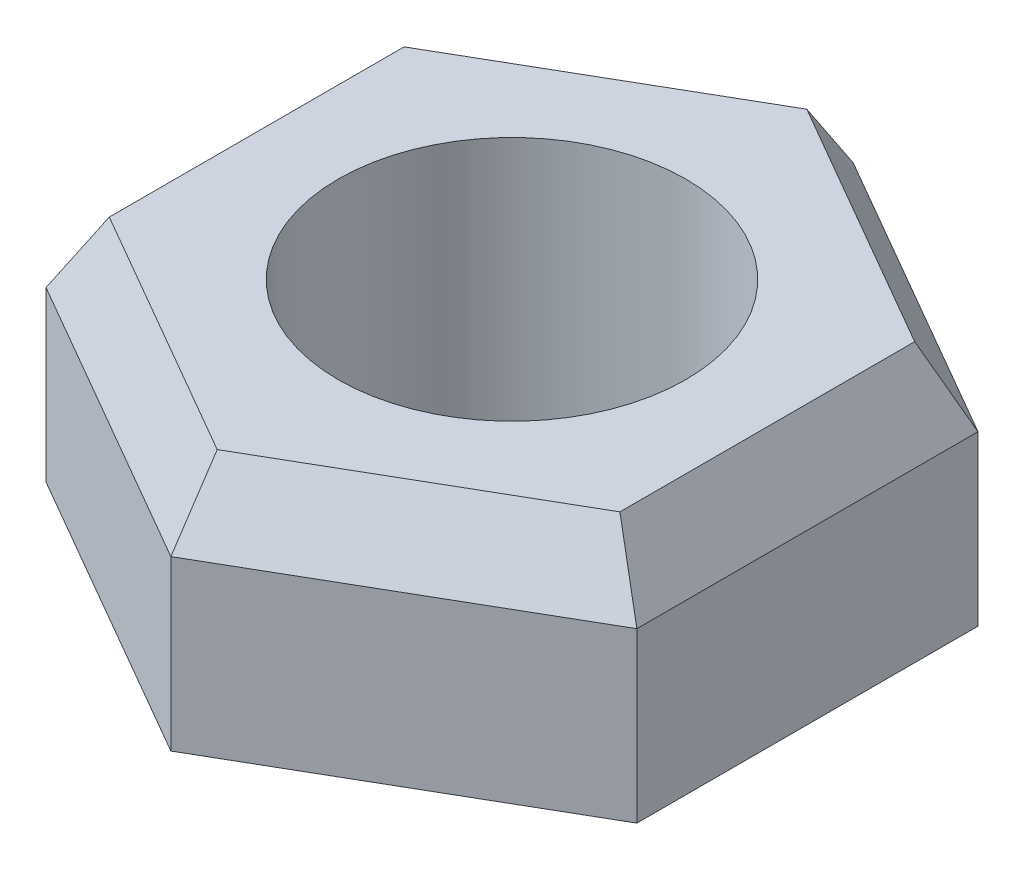
ISO-10303-21;
HEADER;
FILE_DESCRIPTION(('STEP AP214'),'2;1');
FILE_NAME('part.step','',(''),(''),'','','');
FILE_SCHEMA(('AUTOMOTIVE_DESIGN { 1 0 10303 214 1 1 1 1 }'));
ENDSEC;
DATA;
#1=APPLICATION_CONTEXT('core data for automotive mechanical design processes');
#2=APPLICATION_PROTOCOL_DEFINITION('international standard','automotive_design',2000,#1);
#3=PRODUCT_CONTEXT('',#1,'mechanical');
#4=PRODUCT('Part','Part','',(#3));
#5=PRODUCT_RELATED_PRODUCT_CATEGORY('part','',(#4));
#6=PRODUCT_DEFINITION_FORMATION('','',#4);
#7=PRODUCT_DEFINITION_CONTEXT('part definition',#1,'design');
#8=PRODUCT_DEFINITION('design','',#6,#7);
#9=PRODUCT_DEFINITION_SHAPE('','',#8);
#10=(LENGTH_UNIT() NAMED_UNIT(*) SI_UNIT(.MILLI.,.METRE.));
#11=(NAMED_UNIT(*) PLANE_ANGLE_UNIT() SI_UNIT($,.RADIAN.));
#12=(NAMED_UNIT(*) SI_UNIT($,.STERADIAN.) SOLID_ANGLE_UNIT());
#13=UNCERTAINTY_MEASURE_WITH_UNIT(LENGTH_MEASURE(1.E-05),#10,'distance_accuracy_value','');
#14=(GEOMETRIC_REPRESENTATION_CONTEXT(3) GLOBAL_UNCERTAINTY_ASSIGNED_CONTEXT((#13)) GLOBAL_UNIT_ASSIGNED_CONTEXT((#10,
#11,#12)) REPRESENTATION_CONTEXT('',''));
#15=CARTESIAN_POINT('',(0.,0.,0.));
#16=DIRECTION('',(0.,0.,1.));
#17=DIRECTION('',(1.,0.,0.));
#18=AXIS2_PLACEMENT_3D('',#15,#16,#17);
#19=CARTESIAN_POINT('',(0.,8.,0.));
#20=DIRECTION('',(0.,1.,0.));
#21=DIRECTION('',(0.,0.,1.));
#22=AXIS2_PLACEMENT_3D('',#19,#20,#21);
#23=PLANE('',#22);
#24=DIRECTION('',(0.866025403784439,0.,0.5));
#25=VECTOR('',#24,1.);
#26=CARTESIAN_POINT('',(0.577350269189621,8.,8.81495457622364));
#27=LINE('',#26,#25);
#28=CARTESIAN_POINT('',(-7.34529946162075,8.,4.24081062144515));
#29=VERTEX_POINT('',#28);
#30=CARTESIAN_POINT('',(0.,8.,8.48162124289031));
#31=VERTEX_POINT('',#30);
#32=EDGE_CURVE('E129',#29,#31,#27,.T.);
#33=ORIENTED_EDGE('',*,*,#32,.T.);
#34=DIRECTION('',(0.866025403784439,0.,-0.5));
#35=VECTOR('',#34,1.);
#36=CARTESIAN_POINT('',(7.92264973081038,8.,3.90747728811183));
#37=LINE('',#36,#35);
#38=CARTESIAN_POINT('',(7.34529946162075,8.,4.24081062144516));
#39=VERTEX_POINT('',#38);
#40=EDGE_CURVE('E162',#31,#39,#37,.T.);
#41=ORIENTED_EDGE('',*,*,#40,.T.);
#42=DIRECTION('',(0.,0.,-1.));
#43=VECTOR('',#42,1.);
#44=CARTESIAN_POINT('',(7.34529946162075,8.,-4.90747728811182));
#45=LINE('',#44,#43);
#46=CARTESIAN_POINT('',(7.34529946162075,8.,-4.24081062144516));
#47=VERTEX_POINT('',#46);
#48=EDGE_CURVE('E160',#39,#47,#45,.T.);
#49=ORIENTED_EDGE('',*,*,#48,.T.);
#50=DIRECTION('',(-0.866025403784439,0.,-0.5));
#51=VECTOR('',#50,1.);
#52=CARTESIAN_POINT('',(-0.57735026918962,8.,-8.81495457622364));
#53=LINE('',#52,#51);
#54=CARTESIAN_POINT('',(0.,8.,-8.48162124289031));
#55=VERTEX_POINT('',#54);
#56=EDGE_CURVE('E158',#47,#55,#53,.T.);
#57=ORIENTED_EDGE('',*,*,#56,.T.);
#58=DIRECTION('',(-0.866025403784439,0.,0.5));
#59=VECTOR('',#58,1.);
#60=CARTESIAN_POINT('',(-7.92264973081038,8.,-3.90747728811183));
#61=LINE('',#60,#59);
#62=CARTESIAN_POINT('',(-7.34529946162075,8.,-4.24081062144516));
#63=VERTEX_POINT('',#62);
#64=EDGE_CURVE('E132',#55,#63,#61,.T.);
#65=ORIENTED_EDGE('',*,*,#64,.T.);
#66=DIRECTION('',(0.,0.,1.));
#67=VECTOR('',#66,1.);
#68=CARTESIAN_POINT('',(-7.34529946162075,8.,4.90747728811182));
#69=LINE('',#68,#67);
#70=EDGE_CURVE('E124',#63,#29,#69,.T.);
#71=ORIENTED_EDGE('',*,*,#70,.T.);
#72=EDGE_LOOP('',(#33,#41,#49,#57,#65,#71));
#73=FACE_BOUND('',#72,.T.);
#74=CARTESIAN_POINT('',(0.,8.,0.));
#75=DIRECTION('',(0.,1.,0.));
#76=DIRECTION('',(0.,0.,1.));
#77=AXIS2_PLACEMENT_3D('',#74,#75,#76);
#78=CIRCLE('',#77,5.);
#79=CARTESIAN_POINT('',(0.,8.,5.));
#80=VERTEX_POINT('',#79);
#81=EDGE_CURVE('E264',#80,#80,#78,.T.);
#82=ORIENTED_EDGE('',*,*,#81,.F.);
#83=EDGE_LOOP('',(#82));
#84=FACE_BOUND('',#83,.T.);
#85=ADVANCED_FACE('F34',(#73,#84),#23,.T.);
#86=CARTESIAN_POINT('',(0.,0.,0.));
#87=DIRECTION('',(0.,1.,0.));
#88=DIRECTION('',(0.,0.,1.));
#89=AXIS2_PLACEMENT_3D('',#86,#87,#88);
#90=PLANE('',#89);
#91=DIRECTION('',(0.866025403784439,0.,-0.5));
#92=VECTOR('',#91,1.);
#93=CARTESIAN_POINT('',(-3.24999999999999,0.,-5.62916512459884));
#94=LINE('',#93,#92);
#95=CARTESIAN_POINT('',(-6.49999999999999,0.,-3.75277674973256));
#96=VERTEX_POINT('',#95);
#97=CARTESIAN_POINT('',(0.,0.,-7.50555349946512));
#98=VERTEX_POINT('',#97);
#99=EDGE_CURVE('E189',#96,#98,#94,.T.);
#100=ORIENTED_EDGE('',*,*,#99,.T.);
#101=DIRECTION('',(0.866025403784439,0.,0.5));
#102=VECTOR('',#101,1.);
#103=CARTESIAN_POINT('',(3.25,0.,-5.62916512459884));
#104=LINE('',#103,#102);
#105=CARTESIAN_POINT('',(6.49999999999998,0.,-3.75277674973256));
#106=VERTEX_POINT('',#105);
#107=EDGE_CURVE('E11',#98,#106,#104,.T.);
#108=ORIENTED_EDGE('',*,*,#107,.T.);
#109=DIRECTION('',(0.,0.,1.));
#110=VECTOR('',#109,1.);
#111=CARTESIAN_POINT('',(6.49999999999998,0.,0.));
#112=LINE('',#111,#110);
#113=CARTESIAN_POINT('',(6.49999999999998,0.,3.75277674973256));
#114=VERTEX_POINT('',#113);
#115=EDGE_CURVE('E43',#106,#114,#112,.T.);
#116=ORIENTED_EDGE('',*,*,#115,.T.);
#117=DIRECTION('',(-0.866025403784439,0.,0.5));
#118=VECTOR('',#117,1.);
#119=CARTESIAN_POINT('',(3.24999999999999,0.,5.62916512459884));
#120=LINE('',#119,#118);
#121=CARTESIAN_POINT('',(0.,0.,7.50555349946512));
#122=VERTEX_POINT('',#121);
#123=EDGE_CURVE('E195',#114,#122,#120,.T.);
#124=ORIENTED_EDGE('',*,*,#123,.T.);
#125=DIRECTION('',(-0.866025403784439,0.,-0.5));
#126=VECTOR('',#125,1.);
#127=CARTESIAN_POINT('',(-3.24999999999999,0.,5.62916512459884));
#128=LINE('',#127,#126);
#129=CARTESIAN_POINT('',(-6.49999999999999,0.,3.75277674973256));
#130=VERTEX_POINT('',#129);
#131=EDGE_CURVE('E193',#122,#130,#128,.T.);
#132=ORIENTED_EDGE('',*,*,#131,.T.);
#133=DIRECTION('',(0.,0.,-1.));
#134=VECTOR('',#133,1.);
#135=CARTESIAN_POINT('',(-6.49999999999999,0.,0.));
#136=LINE('',#135,#134);
#137=EDGE_CURVE('E191',#130,#96,#136,.T.);
#138=ORIENTED_EDGE('',*,*,#137,.T.);
#139=EDGE_LOOP('',(#100,#108,#116,#124,#132,#138));
#140=FACE_BOUND('',#139,.T.);
#141=CARTESIAN_POINT('',(0.,0.,0.));
#142=DIRECTION('',(0.,1.,0.));
#143=DIRECTION('',(0.,0.,1.));
#144=AXIS2_PLACEMENT_3D('',#141,#142,#143);
#145=CIRCLE('',#144,5.);
#146=CARTESIAN_POINT('',(0.,0.,5.));
#147=VERTEX_POINT('',#146);
#148=EDGE_CURVE('E207',#147,#147,#145,.T.);
#149=ORIENTED_EDGE('',*,*,#148,.T.);
#150=EDGE_LOOP('',(#149));
#151=FACE_BOUND('',#150,.T.);
#152=ADVANCED_FACE('F231',(#140,#151),#90,.F.);
#153=CARTESIAN_POINT('',(0.,8.,9.81495457622364));
#154=DIRECTION('',(-0.5,0.,-0.866025403784439));
#155=DIRECTION('',(-0.866025403784439,0.,0.5));
#156=AXIS2_PLACEMENT_3D('',#153,#154,#155);
#157=PLANE('',#156);
#158=DIRECTION('',(0.,-1.,0.));
#159=VECTOR('',#158,1.);
#160=CARTESIAN_POINT('',(8.5,8.,4.90747728811182));
#161=LINE('',#160,#159);
#162=CARTESIAN_POINT('',(8.5,5.99999999999999,4.90747728811182));
#163=VERTEX_POINT('',#162);
#164=CARTESIAN_POINT('',(8.5,1.15470053837925,4.90747728811182));
#165=VERTEX_POINT('',#164);
#166=EDGE_CURVE('E150',#163,#165,#161,.T.);
#167=ORIENTED_EDGE('',*,*,#166,.F.);
#168=DIRECTION('',(-0.866025403784439,0.,0.5));
#169=VECTOR('',#168,1.);
#170=CARTESIAN_POINT('',(0.,6.,9.81495457622364));
#171=LINE('',#170,#169);
#172=CARTESIAN_POINT('',(0.,6.,9.81495457622364));
#173=VERTEX_POINT('',#172);
#174=EDGE_CURVE('E166',#163,#173,#171,.T.);
#175=ORIENTED_EDGE('',*,*,#174,.T.);
#176=DIRECTION('',(0.,-1.,0.));
#177=VECTOR('',#176,1.);
#178=CARTESIAN_POINT('',(0.,8.,9.81495457622364));
#179=LINE('',#178,#177);
#180=CARTESIAN_POINT('',(0.,1.15470053837925,9.81495457622364));
#181=VERTEX_POINT('',#180);
#182=EDGE_CURVE('E261',#173,#181,#179,.T.);
#183=ORIENTED_EDGE('',*,*,#182,.T.);
#184=DIRECTION('',(0.866025403784439,0.,-0.5));
#185=VECTOR('',#184,1.);
#186=CARTESIAN_POINT('',(0.,1.15470053837925,9.81495457622364));
#187=LINE('',#186,#185);
#188=EDGE_CURVE('E164',#181,#165,#187,.T.);
#189=ORIENTED_EDGE('',*,*,#188,.T.);
#190=EDGE_LOOP('',(#167,#175,#183,#189));
#191=FACE_BOUND('',#190,.T.);
#192=ADVANCED_FACE('F277',(#191),#157,.F.);
#193=CARTESIAN_POINT('',(8.5,8.,4.90747728811182));
#194=DIRECTION('',(-1.,0.,0.));
#195=DIRECTION('',(0.,0.,1.));
#196=AXIS2_PLACEMENT_3D('',#193,#194,#195);
#197=PLANE('',#196);
#198=DIRECTION('',(0.,-1.,0.));
#199=VECTOR('',#198,1.);
#200=CARTESIAN_POINT('',(8.5,8.,-4.90747728811182));
#201=LINE('',#200,#199);
#202=CARTESIAN_POINT('',(8.5,5.99999999999999,-4.90747728811182));
#203=VERTEX_POINT('',#202);
#204=CARTESIAN_POINT('',(8.5,1.15470053837925,-4.90747728811182));
#205=VERTEX_POINT('',#204);
#206=EDGE_CURVE('E153',#203,#205,#201,.T.);
#207=ORIENTED_EDGE('',*,*,#206,.F.);
#208=DIRECTION('',(0.,0.,1.));
#209=VECTOR('',#208,1.);
#210=CARTESIAN_POINT('',(8.5,5.99999999999999,4.90747728811182));
#211=LINE('',#210,#209);
#212=EDGE_CURVE('E171',#203,#163,#211,.T.);
#213=ORIENTED_EDGE('',*,*,#212,.T.);
#214=ORIENTED_EDGE('',*,*,#166,.T.);
#215=DIRECTION('',(0.,0.,-1.));
#216=VECTOR('',#215,1.);
#217=CARTESIAN_POINT('',(8.5,1.15470053837925,4.90747728811182));
#218=LINE('',#217,#216);
#219=EDGE_CURVE('E169',#165,#205,#218,.T.);
#220=ORIENTED_EDGE('',*,*,#219,.T.);
#221=EDGE_LOOP('',(#207,#213,#214,#220));
#222=FACE_BOUND('',#221,.T.);
#223=ADVANCED_FACE('F293',(#222),#197,.F.);
#224=CARTESIAN_POINT('',(8.5,8.,-4.90747728811182));
#225=DIRECTION('',(-0.5,0.,0.866025403784439));
#226=DIRECTION('',(0.866025403784439,0.,0.5));
#227=AXIS2_PLACEMENT_3D('',#224,#225,#226);
#228=PLANE('',#227);
#229=DIRECTION('',(0.,-1.,0.));
#230=VECTOR('',#229,1.);
#231=CARTESIAN_POINT('',(0.,8.,-9.81495457622364));
#232=LINE('',#231,#230);
#233=CARTESIAN_POINT('',(0.,5.99999999999999,-9.81495457622364));
#234=VERTEX_POINT('',#233);
#235=CARTESIAN_POINT('',(0.,1.15470053837925,-9.81495457622364));
#236=VERTEX_POINT('',#235);
#237=EDGE_CURVE('E246',#234,#236,#232,.T.);
#238=ORIENTED_EDGE('',*,*,#237,.F.);
#239=DIRECTION('',(0.866025403784439,0.,0.5));
#240=VECTOR('',#239,1.);
#241=CARTESIAN_POINT('',(8.5,5.99999999999999,-4.90747728811182));
#242=LINE('',#241,#240);
#243=EDGE_CURVE('E176',#234,#203,#242,.T.);
#244=ORIENTED_EDGE('',*,*,#243,.T.);
#245=ORIENTED_EDGE('',*,*,#206,.T.);
#246=DIRECTION('',(-0.866025403784439,0.,-0.5));
#247=VECTOR('',#246,1.);
#248=CARTESIAN_POINT('',(8.5,1.15470053837925,-4.90747728811182));
#249=LINE('',#248,#247);
#250=EDGE_CURVE('E173',#205,#236,#249,.T.);
#251=ORIENTED_EDGE('',*,*,#250,.T.);
#252=EDGE_LOOP('',(#238,#244,#245,#251));
#253=FACE_BOUND('',#252,.T.);
#254=ADVANCED_FACE('F245',(#253),#228,.F.);
#255=CARTESIAN_POINT('',(0.,8.,-9.81495457622364));
#256=DIRECTION('',(0.5,0.,0.866025403784439));
#257=DIRECTION('',(0.866025403784439,0.,-0.5));
#258=AXIS2_PLACEMENT_3D('',#255,#256,#257);
#259=PLANE('',#258);
#260=DIRECTION('',(0.,-1.,0.));
#261=VECTOR('',#260,1.);
#262=CARTESIAN_POINT('',(-8.5,8.,-4.90747728811182));
#263=LINE('',#262,#261);
#264=CARTESIAN_POINT('',(-8.5,5.99999999999999,-4.90747728811182));
#265=VERTEX_POINT('',#264);
#266=CARTESIAN_POINT('',(-8.5,1.15470053837925,-4.90747728811182));
#267=VERTEX_POINT('',#266);
#268=EDGE_CURVE('E254',#265,#267,#263,.T.);
#269=ORIENTED_EDGE('',*,*,#268,.F.);
#270=DIRECTION('',(0.866025403784439,0.,-0.5));
#271=VECTOR('',#270,1.);
#272=CARTESIAN_POINT('',(0.,5.99999999999999,-9.81495457622364));
#273=LINE('',#272,#271);
#274=EDGE_CURVE('E180',#265,#234,#273,.T.);
#275=ORIENTED_EDGE('',*,*,#274,.T.);
#276=ORIENTED_EDGE('',*,*,#237,.T.);
#277=DIRECTION('',(-0.866025403784439,0.,0.5));
#278=VECTOR('',#277,1.);
#279=CARTESIAN_POINT('',(0.,1.15470053837925,-9.81495457622364));
#280=LINE('',#279,#278);
#281=EDGE_CURVE('E178',#236,#267,#280,.T.);
#282=ORIENTED_EDGE('',*,*,#281,.T.);
#283=EDGE_LOOP('',(#269,#275,#276,#282));
#284=FACE_BOUND('',#283,.T.);
#285=ADVANCED_FACE('F251',(#284),#259,.F.);
#286=CARTESIAN_POINT('',(-8.5,8.,-4.90747728811182));
#287=DIRECTION('',(1.,0.,0.));
#288=DIRECTION('',(0.,0.,-1.));
#289=AXIS2_PLACEMENT_3D('',#286,#287,#288);
#290=PLANE('',#289);
#291=DIRECTION('',(0.,-1.,0.));
#292=VECTOR('',#291,1.);
#293=CARTESIAN_POINT('',(-8.5,8.,4.90747728811182));
#294=LINE('',#293,#292);
#295=CARTESIAN_POINT('',(-8.5,6.,4.90747728811182));
#296=VERTEX_POINT('',#295);
#297=CARTESIAN_POINT('',(-8.5,1.15470053837925,4.90747728811182));
#298=VERTEX_POINT('',#297);
#299=EDGE_CURVE('E256',#296,#298,#294,.T.);
#300=ORIENTED_EDGE('',*,*,#299,.F.);
#301=DIRECTION('',(0.,0.,-1.));
#302=VECTOR('',#301,1.);
#303=CARTESIAN_POINT('',(-8.5,5.99999999999999,-4.90747728811182));
#304=LINE('',#303,#302);
#305=EDGE_CURVE('E141',#296,#265,#304,.T.);
#306=ORIENTED_EDGE('',*,*,#305,.T.);
#307=ORIENTED_EDGE('',*,*,#268,.T.);
#308=DIRECTION('',(0.,0.,1.));
#309=VECTOR('',#308,1.);
#310=CARTESIAN_POINT('',(-8.5,1.15470053837925,-4.90747728811182));
#311=LINE('',#310,#309);
#312=EDGE_CURVE('E182',#267,#298,#311,.T.);
#313=ORIENTED_EDGE('',*,*,#312,.T.);
#314=EDGE_LOOP('',(#300,#306,#307,#313));
#315=FACE_BOUND('',#314,.T.);
#316=ADVANCED_FACE('F284',(#315),#290,.F.);
#317=CARTESIAN_POINT('',(-8.5,8.,4.90747728811182));
#318=DIRECTION('',(0.5,0.,-0.866025403784438));
#319=DIRECTION('',(-0.866025403784438,0.,-0.5));
#320=AXIS2_PLACEMENT_3D('',#317,#318,#319);
#321=PLANE('',#320);
#322=ORIENTED_EDGE('',*,*,#182,.F.);
#323=DIRECTION('',(-0.866025403784438,0.,-0.5));
#324=VECTOR('',#323,1.);
#325=CARTESIAN_POINT('',(-8.5,6.,4.90747728811182));
#326=LINE('',#325,#324);
#327=EDGE_CURVE('E187',#173,#296,#326,.T.);
#328=ORIENTED_EDGE('',*,*,#327,.T.);
#329=ORIENTED_EDGE('',*,*,#299,.T.);
#330=DIRECTION('',(0.866025403784438,0.,0.5));
#331=VECTOR('',#330,1.);
#332=CARTESIAN_POINT('',(-8.5,1.15470053837925,4.90747728811182));
#333=LINE('',#332,#331);
#334=EDGE_CURVE('E185',#298,#181,#333,.T.);
#335=ORIENTED_EDGE('',*,*,#334,.T.);
#336=EDGE_LOOP('',(#322,#328,#329,#335));
#337=FACE_BOUND('',#336,.T.);
#338=ADVANCED_FACE('F281',(#337),#321,.F.);
#339=CARTESIAN_POINT('',(0.,8.,0.));
#340=DIRECTION('',(0.,-1.,0.));
#341=DIRECTION('',(0.,0.,-1.));
#342=AXIS2_PLACEMENT_3D('',#339,#340,#341);
#343=CYLINDRICAL_SURFACE('',#342,5.);
#344=ORIENTED_EDGE('',*,*,#81,.T.);
#345=EDGE_LOOP('',(#344));
#346=FACE_BOUND('',#345,.T.);
#347=ORIENTED_EDGE('',*,*,#148,.F.);
#348=EDGE_LOOP('',(#347));
#349=FACE_BOUND('',#348,.T.);
#350=ADVANCED_FACE('F270',(#346,#349),#343,.F.);
#351=CARTESIAN_POINT('',(-3.67264973081038,8.,-6.36121593216774));
#352=DIRECTION('',(-0.43301270189222,0.499999999999998,-0.750000000000001));
#353=DIRECTION('',(0.866025403784439,0.,-0.5));
#354=AXIS2_PLACEMENT_3D('',#351,#352,#353);
#355=PLANE('',#354);
#356=DIRECTION('',(0.,-0.832050294337845,-0.554700196225227));
#357=VECTOR('',#356,1.);
#358=CARTESIAN_POINT('',(0.,8.97864860494888,-7.82918883959106));
#359=LINE('',#358,#357);
#360=EDGE_CURVE('E144',#234,#55,#359,.F.);
#361=ORIENTED_EDGE('',*,*,#360,.F.);
#362=ORIENTED_EDGE('',*,*,#274,.F.);
#363=DIRECTION('',(-0.480384461415259,-0.832050294337845,-0.277350098112614));
#364=VECTOR('',#363,1.);
#365=CARTESIAN_POINT('',(-6.78027642611147,8.97864860494888,-3.91459441979553));
#366=LINE('',#365,#364);
#367=EDGE_CURVE('E205',#63,#265,#366,.T.);
#368=ORIENTED_EDGE('',*,*,#367,.F.);
#369=ORIENTED_EDGE('',*,*,#64,.F.);
#370=EDGE_LOOP('',(#361,#362,#368,#369));
#371=FACE_BOUND('',#370,.T.);
#372=ADVANCED_FACE('F316',(#371),#355,.T.);
#373=CARTESIAN_POINT('',(-7.34529946162075,8.,0.));
#374=DIRECTION('',(-0.86602540378444,0.499999999999998,0.));
#375=DIRECTION('',(0.,0.,-1.));
#376=AXIS2_PLACEMENT_3D('',#373,#374,#375);
#377=PLANE('',#376);
#378=ORIENTED_EDGE('',*,*,#367,.T.);
#379=ORIENTED_EDGE('',*,*,#305,.F.);
#380=DIRECTION('',(-0.480384461415259,-0.832050294337845,0.277350098112613));
#381=VECTOR('',#380,1.);
#382=CARTESIAN_POINT('',(-6.78027642611147,8.97864860494888,3.91459441979553));
#383=LINE('',#382,#381);
#384=EDGE_CURVE('E139',#29,#296,#383,.T.);
#385=ORIENTED_EDGE('',*,*,#384,.F.);
#386=ORIENTED_EDGE('',*,*,#70,.F.);
#387=EDGE_LOOP('',(#378,#379,#385,#386));
#388=FACE_BOUND('',#387,.T.);
#389=ADVANCED_FACE('F140',(#388),#377,.T.);
#390=CARTESIAN_POINT('',(3.67264973081038,8.,-6.36121593216774));
#391=DIRECTION('',(0.43301270189222,0.499999999999998,-0.750000000000001));
#392=DIRECTION('',(0.866025403784439,0.,0.5));
#393=AXIS2_PLACEMENT_3D('',#390,#391,#392);
#394=PLANE('',#393);
#395=ORIENTED_EDGE('',*,*,#360,.T.);
#396=ORIENTED_EDGE('',*,*,#56,.F.);
#397=DIRECTION('',(0.480384461415259,-0.832050294337845,-0.277350098112614));
#398=VECTOR('',#397,1.);
#399=CARTESIAN_POINT('',(6.78027642611147,8.97864860494888,-3.91459441979554));
#400=LINE('',#399,#398);
#401=EDGE_CURVE('E145',#203,#47,#400,.F.);
#402=ORIENTED_EDGE('',*,*,#401,.F.);
#403=ORIENTED_EDGE('',*,*,#243,.F.);
#404=EDGE_LOOP('',(#395,#396,#402,#403));
#405=FACE_BOUND('',#404,.T.);
#406=ADVANCED_FACE('F310',(#405),#394,.T.);
#407=CARTESIAN_POINT('',(-3.67264973081038,8.,6.36121593216773));
#408=DIRECTION('',(-0.43301270189222,0.499999999999998,0.750000000000001));
#409=DIRECTION('',(-0.866025403784438,0.,-0.5));
#410=AXIS2_PLACEMENT_3D('',#407,#408,#409);
#411=PLANE('',#410);
#412=ORIENTED_EDGE('',*,*,#384,.T.);
#413=ORIENTED_EDGE('',*,*,#327,.F.);
#414=DIRECTION('',(0.,0.832050294337845,-0.554700196225227));
#415=VECTOR('',#414,1.);
#416=CARTESIAN_POINT('',(0.,8.97864860494888,7.82918883959106));
#417=LINE('',#416,#415);
#418=EDGE_CURVE('E148',#31,#173,#417,.F.);
#419=ORIENTED_EDGE('',*,*,#418,.F.);
#420=ORIENTED_EDGE('',*,*,#32,.F.);
#421=EDGE_LOOP('',(#412,#413,#419,#420));
#422=FACE_BOUND('',#421,.T.);
#423=ADVANCED_FACE('F147',(#422),#411,.T.);
#424=CARTESIAN_POINT('',(7.34529946162075,8.,0.));
#425=DIRECTION('',(0.86602540378444,0.499999999999998,0.));
#426=DIRECTION('',(0.,0.,1.));
#427=AXIS2_PLACEMENT_3D('',#424,#425,#426);
#428=PLANE('',#427);
#429=ORIENTED_EDGE('',*,*,#401,.T.);
#430=ORIENTED_EDGE('',*,*,#48,.F.);
#431=DIRECTION('',(0.480384461415259,-0.832050294337845,0.277350098112614));
#432=VECTOR('',#431,1.);
#433=CARTESIAN_POINT('',(6.78027642611147,8.97864860494888,3.91459441979553));
#434=LINE('',#433,#432);
#435=EDGE_CURVE('E198',#163,#39,#434,.F.);
#436=ORIENTED_EDGE('',*,*,#435,.F.);
#437=ORIENTED_EDGE('',*,*,#212,.F.);
#438=EDGE_LOOP('',(#429,#430,#436,#437));
#439=FACE_BOUND('',#438,.T.);
#440=ADVANCED_FACE('F303',(#439),#428,.T.);
#441=CARTESIAN_POINT('',(3.67264973081037,8.,6.36121593216774));
#442=DIRECTION('',(0.43301270189222,0.499999999999998,0.750000000000001));
#443=DIRECTION('',(-0.866025403784439,0.,0.5));
#444=AXIS2_PLACEMENT_3D('',#441,#442,#443);
#445=PLANE('',#444);
#446=ORIENTED_EDGE('',*,*,#418,.T.);
#447=ORIENTED_EDGE('',*,*,#174,.F.);
#448=ORIENTED_EDGE('',*,*,#435,.T.);
#449=ORIENTED_EDGE('',*,*,#40,.F.);
#450=EDGE_LOOP('',(#446,#447,#448,#449));
#451=FACE_BOUND('',#450,.T.);
#452=ADVANCED_FACE('F300',(#451),#445,.T.);
#453=CARTESIAN_POINT('',(-8.5,1.15470053837925,4.90747728811182));
#454=DIRECTION('',(0.249999999999999,0.86602540378444,-0.433012701892217));
#455=DIRECTION('',(0.866025403784438,0.,0.5));
#456=AXIS2_PLACEMENT_3D('',#453,#454,#455);
#457=PLANE('',#456);
#458=DIRECTION('',(-0.774596669241485,0.447213595499956,0.447213595499958));
#459=VECTOR('',#458,1.);
#460=CARTESIAN_POINT('',(-5.1,-0.808290376865466,2.94448637286709));
#461=LINE('',#460,#459);
#462=EDGE_CURVE('E216',#130,#298,#461,.T.);
#463=ORIENTED_EDGE('',*,*,#462,.F.);
#464=ORIENTED_EDGE('',*,*,#131,.F.);
#465=DIRECTION('',(0.,0.447213595499956,0.894427190999917));
#466=VECTOR('',#465,1.);
#467=CARTESIAN_POINT('',(0.,-0.808290376865467,5.88897274573417));
#468=LINE('',#467,#466);
#469=EDGE_CURVE('E38',#181,#122,#468,.F.);
#470=ORIENTED_EDGE('',*,*,#469,.F.);
#471=ORIENTED_EDGE('',*,*,#334,.F.);
#472=EDGE_LOOP('',(#463,#464,#470,#471));
#473=FACE_BOUND('',#472,.T.);
#474=ADVANCED_FACE('F36',(#473),#457,.F.);
#475=CARTESIAN_POINT('',(0.,1.15470053837925,9.81495457622364));
#476=DIRECTION('',(-0.249999999999999,0.86602540378444,-0.433012701892218));
#477=DIRECTION('',(0.866025403784439,0.,-0.5));
#478=AXIS2_PLACEMENT_3D('',#475,#476,#477);
#479=PLANE('',#478);
#480=ORIENTED_EDGE('',*,*,#469,.T.);
#481=ORIENTED_EDGE('',*,*,#123,.F.);
#482=DIRECTION('',(0.774596669241484,0.447213595499956,0.447213595499959));
#483=VECTOR('',#482,1.);
#484=CARTESIAN_POINT('',(5.09999999999999,-0.808290376865467,2.94448637286709));
#485=LINE('',#484,#483);
#486=EDGE_CURVE('E214',#165,#114,#485,.F.);
#487=ORIENTED_EDGE('',*,*,#486,.F.);
#488=ORIENTED_EDGE('',*,*,#188,.F.);
#489=EDGE_LOOP('',(#480,#481,#487,#488));
#490=FACE_BOUND('',#489,.T.);
#491=ADVANCED_FACE('F226',(#490),#479,.F.);
#492=CARTESIAN_POINT('',(-8.5,1.15470053837925,-4.90747728811182));
#493=DIRECTION('',(0.499999999999998,0.86602540378444,0.));
#494=DIRECTION('',(0.,0.,1.));
#495=AXIS2_PLACEMENT_3D('',#492,#493,#494);
#496=PLANE('',#495);
#497=ORIENTED_EDGE('',*,*,#462,.T.);
#498=ORIENTED_EDGE('',*,*,#312,.F.);
#499=DIRECTION('',(-0.774596669241484,0.447213595499956,-0.447213595499959));
#500=VECTOR('',#499,1.);
#501=CARTESIAN_POINT('',(-5.1,-0.808290376865466,-2.94448637286709));
#502=LINE('',#501,#500);
#503=EDGE_CURVE('E211',#96,#267,#502,.T.);
#504=ORIENTED_EDGE('',*,*,#503,.F.);
#505=ORIENTED_EDGE('',*,*,#137,.F.);
#506=EDGE_LOOP('',(#497,#498,#504,#505));
#507=FACE_BOUND('',#506,.T.);
#508=ADVANCED_FACE('F235',(#507),#496,.F.);
#509=CARTESIAN_POINT('',(8.5,1.15470053837925,4.90747728811182));
#510=DIRECTION('',(-0.499999999999998,0.86602540378444,0.));
#511=DIRECTION('',(0.,0.,-1.));
#512=AXIS2_PLACEMENT_3D('',#509,#510,#511);
#513=PLANE('',#512);
#514=ORIENTED_EDGE('',*,*,#486,.T.);
#515=ORIENTED_EDGE('',*,*,#115,.F.);
#516=DIRECTION('',(0.774596669241484,0.447213595499956,-0.447213595499958));
#517=VECTOR('',#516,1.);
#518=CARTESIAN_POINT('',(5.09999999999999,-0.808290376865468,-2.94448637286709));
#519=LINE('',#518,#517);
#520=EDGE_CURVE('E51',#205,#106,#519,.F.);
#521=ORIENTED_EDGE('',*,*,#520,.F.);
#522=ORIENTED_EDGE('',*,*,#219,.F.);
#523=EDGE_LOOP('',(#514,#515,#521,#522));
#524=FACE_BOUND('',#523,.T.);
#525=ADVANCED_FACE('F324',(#524),#513,.F.);
#526=CARTESIAN_POINT('',(0.,1.15470053837925,-9.81495457622364));
#527=DIRECTION('',(0.249999999999999,0.86602540378444,0.433012701892217));
#528=DIRECTION('',(-0.866025403784439,0.,0.5));
#529=AXIS2_PLACEMENT_3D('',#526,#527,#528);
#530=PLANE('',#529);
#531=ORIENTED_EDGE('',*,*,#503,.T.);
#532=ORIENTED_EDGE('',*,*,#281,.F.);
#533=DIRECTION('',(0.,-0.447213595499956,0.894427190999917));
#534=VECTOR('',#533,1.);
#535=CARTESIAN_POINT('',(0.,1.15470053837925,-9.81495457622364));
#536=LINE('',#535,#534);
#537=EDGE_CURVE('E208',#98,#236,#536,.F.);
#538=ORIENTED_EDGE('',*,*,#537,.F.);
#539=ORIENTED_EDGE('',*,*,#99,.F.);
#540=EDGE_LOOP('',(#531,#532,#538,#539));
#541=FACE_BOUND('',#540,.T.);
#542=ADVANCED_FACE('F239',(#541),#530,.F.);
#543=CARTESIAN_POINT('',(8.5,1.15470053837925,-4.90747728811182));
#544=DIRECTION('',(-0.249999999999999,0.86602540378444,0.433012701892217));
#545=DIRECTION('',(-0.866025403784439,0.,-0.5));
#546=AXIS2_PLACEMENT_3D('',#543,#544,#545);
#547=PLANE('',#546);
#548=ORIENTED_EDGE('',*,*,#520,.T.);
#549=ORIENTED_EDGE('',*,*,#107,.F.);
#550=ORIENTED_EDGE('',*,*,#537,.T.);
#551=ORIENTED_EDGE('',*,*,#250,.F.);
#552=EDGE_LOOP('',(#548,#549,#550,#551));
#553=FACE_BOUND('',#552,.T.);
#554=ADVANCED_FACE('F240',(#553),#547,.F.);
#555=CLOSED_SHELL('',(#85,#152,#192,#223,#254,#285,#316,#338,#350,#372,#389,#406,#423,#440,#452,
#474,#491,#508,#525,#542,#554));
#556=MANIFOLD_SOLID_BREP('B2',#555);
#557=ADVANCED_BREP_SHAPE_REPRESENTATION('',(#18,#556),#14);
#558=SHAPE_DEFINITION_REPRESENTATION(#9,#557);
ENDSEC;
END-ISO-10303-21;
